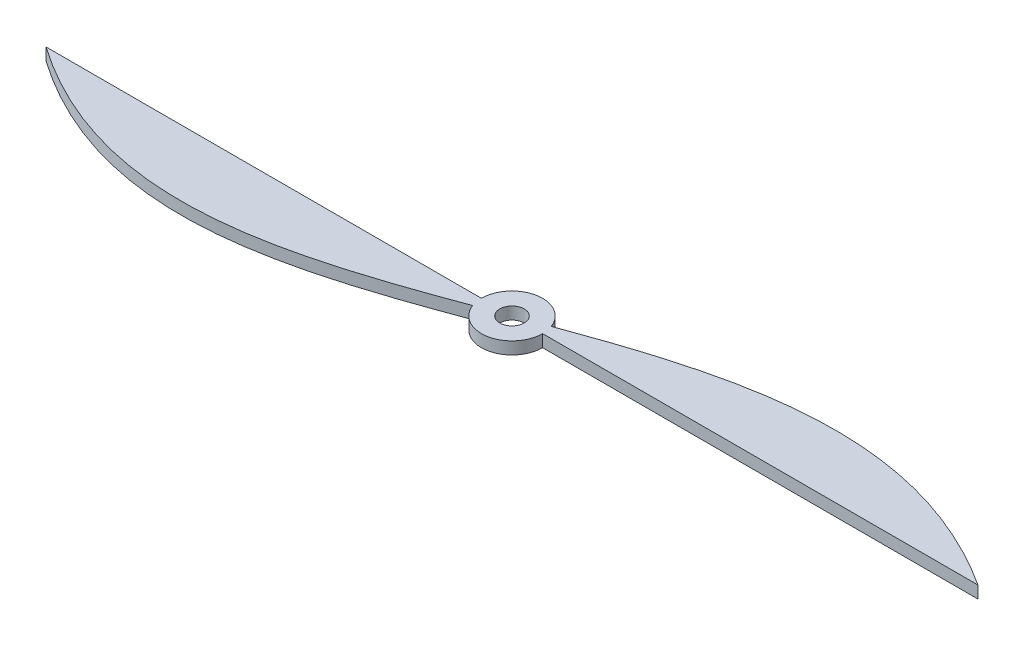
ISO-10303-21;
HEADER;
FILE_DESCRIPTION(('STEP AP214'),'2;1');
FILE_NAME('part.step','',(''),(''),'','','');
FILE_SCHEMA(('AUTOMOTIVE_DESIGN { 1 0 10303 214 1 1 1 1 }'));
ENDSEC;
DATA;
#1=APPLICATION_CONTEXT('core data for automotive mechanical design processes');
#2=APPLICATION_PROTOCOL_DEFINITION('international standard','automotive_design',2000,#1);
#3=PRODUCT_CONTEXT('',#1,'mechanical');
#4=PRODUCT('Part','Part','',(#3));
#5=PRODUCT_RELATED_PRODUCT_CATEGORY('part','',(#4));
#6=PRODUCT_DEFINITION_FORMATION('','',#4);
#7=PRODUCT_DEFINITION_CONTEXT('part definition',#1,'design');
#8=PRODUCT_DEFINITION('design','',#6,#7);
#9=PRODUCT_DEFINITION_SHAPE('','',#8);
#10=(LENGTH_UNIT() NAMED_UNIT(*) SI_UNIT(.MILLI.,.METRE.));
#11=(NAMED_UNIT(*) PLANE_ANGLE_UNIT() SI_UNIT($,.RADIAN.));
#12=(NAMED_UNIT(*) SI_UNIT($,.STERADIAN.) SOLID_ANGLE_UNIT());
#13=UNCERTAINTY_MEASURE_WITH_UNIT(LENGTH_MEASURE(1.E-05),#10,'distance_accuracy_value','');
#14=(GEOMETRIC_REPRESENTATION_CONTEXT(3) GLOBAL_UNCERTAINTY_ASSIGNED_CONTEXT((#13)) GLOBAL_UNIT_ASSIGNED_CONTEXT((#10,
#11,#12)) REPRESENTATION_CONTEXT('',''));
#15=CARTESIAN_POINT('',(0.,0.,0.));
#16=DIRECTION('',(0.,0.,1.));
#17=DIRECTION('',(1.,0.,0.));
#18=AXIS2_PLACEMENT_3D('',#15,#16,#17);
#19=CARTESIAN_POINT('',(0.,2.,0.));
#20=DIRECTION('',(0.,-1.,0.));
#21=DIRECTION('',(0.,0.,-1.));
#22=AXIS2_PLACEMENT_3D('',#19,#20,#21);
#23=CYLINDRICAL_SURFACE('',#22,5.);
#24=CARTESIAN_POINT('',(0.,0.,0.));
#25=DIRECTION('',(0.,1.,0.));
#26=DIRECTION('',(0.,0.,1.));
#27=AXIS2_PLACEMENT_3D('',#24,#25,#26);
#28=CIRCLE('',#27,5.);
#29=CARTESIAN_POINT('',(-4.68692498776939,0.,1.74147470812037));
#30=VERTEX_POINT('',#29);
#31=CARTESIAN_POINT('',(5.,0.,0.));
#32=VERTEX_POINT('',#31);
#33=EDGE_CURVE('E168',#30,#32,#28,.T.);
#34=ORIENTED_EDGE('',*,*,#33,.T.);
#35=DIRECTION('',(0.,-1.,0.));
#36=VECTOR('',#35,1.);
#37=CARTESIAN_POINT('',(5.,2.,0.));
#38=LINE('',#37,#36);
#39=CARTESIAN_POINT('',(5.,2.,0.));
#40=VERTEX_POINT('',#39);
#41=EDGE_CURVE('E11',#40,#32,#38,.T.);
#42=ORIENTED_EDGE('',*,*,#41,.F.);
#43=CARTESIAN_POINT('',(0.,2.,0.));
#44=DIRECTION('',(0.,1.,0.));
#45=DIRECTION('',(0.,0.,1.));
#46=AXIS2_PLACEMENT_3D('',#43,#44,#45);
#47=CIRCLE('',#46,5.);
#48=CARTESIAN_POINT('',(-4.68692498776939,2.,1.74147470812037));
#49=VERTEX_POINT('',#48);
#50=EDGE_CURVE('E143',#49,#40,#47,.T.);
#51=ORIENTED_EDGE('',*,*,#50,.F.);
#52=DIRECTION('',(0.,-1.,0.));
#53=VECTOR('',#52,1.);
#54=CARTESIAN_POINT('',(-4.68692498776939,2.,1.74147470812037));
#55=LINE('',#54,#53);
#56=EDGE_CURVE('E157',#49,#30,#55,.T.);
#57=ORIENTED_EDGE('',*,*,#56,.T.);
#58=EDGE_LOOP('',(#34,#42,#51,#57));
#59=FACE_BOUND('',#58,.T.);
#60=ADVANCED_FACE('F30',(#59),#23,.T.);
#61=CARTESIAN_POINT('',(0.,2.,0.));
#62=DIRECTION('',(0.,0.,-1.));
#63=DIRECTION('',(-1.,0.,0.));
#64=AXIS2_PLACEMENT_3D('',#61,#62,#63);
#65=PLANE('',#64);
#66=DIRECTION('',(1.,0.,0.));
#67=VECTOR('',#66,1.);
#68=CARTESIAN_POINT('',(0.,0.,0.));
#69=LINE('',#68,#67);
#70=CARTESIAN_POINT('',(76.2,0.,0.));
#71=VERTEX_POINT('',#70);
#72=EDGE_CURVE('E164',#32,#71,#69,.T.);
#73=ORIENTED_EDGE('',*,*,#72,.T.);
#74=DIRECTION('',(0.,-1.,0.));
#75=VECTOR('',#74,1.);
#76=CARTESIAN_POINT('',(76.2,2.,0.));
#77=LINE('',#76,#75);
#78=CARTESIAN_POINT('',(76.2,2.,0.));
#79=VERTEX_POINT('',#78);
#80=EDGE_CURVE('E38',#79,#71,#77,.T.);
#81=ORIENTED_EDGE('',*,*,#80,.F.);
#82=DIRECTION('',(1.,0.,0.));
#83=VECTOR('',#82,1.);
#84=CARTESIAN_POINT('',(0.,2.,0.));
#85=LINE('',#84,#83);
#86=EDGE_CURVE('E79',#40,#79,#85,.T.);
#87=ORIENTED_EDGE('',*,*,#86,.F.);
#88=ORIENTED_EDGE('',*,*,#41,.T.);
#89=EDGE_LOOP('',(#73,#81,#87,#88));
#90=FACE_BOUND('',#89,.T.);
#91=ADVANCED_FACE('F133',(#90),#65,.F.);
#92=CARTESIAN_POINT('',(-76.2,2.,0.));
#93=CARTESIAN_POINT('',(-23.1930493864501,2.,37.0059512644246));
#94=CARTESIAN_POINT('',(20.4320097091821,2.,-35.9781712708018));
#95=CARTESIAN_POINT('',(76.2,2.,0.));
#96=B_SPLINE_CURVE_WITH_KNOTS('',3,(#92,#93,#94,#95),.UNSPECIFIED.,.F.,.F.,(4,4),(0.,1.),.UNSPECIFIED.);
#97=DIRECTION('',(0.,-1.,0.));
#98=VECTOR('',#97,1.);
#99=SURFACE_OF_LINEAR_EXTRUSION('',#96,#98);
#100=CARTESIAN_POINT('',(-76.2,0.,0.));
#101=CARTESIAN_POINT('',(-23.1930493864501,0.,37.0059512644246));
#102=CARTESIAN_POINT('',(20.4320097091821,0.,-35.9781712708018));
#103=CARTESIAN_POINT('',(76.2,0.,0.));
#104=B_SPLINE_CURVE_WITH_KNOTS('',3,(#100,#101,#102,#103),.UNSPECIFIED.,.F.,.F.,(4,4),(0.,1.),.UNSPECIFIED.);
#105=CARTESIAN_POINT('',(4.69008689020187,0.,-1.73294113066675));
#106=VERTEX_POINT('',#105);
#107=EDGE_CURVE('E163',#106,#71,#104,.T.);
#108=ORIENTED_EDGE('',*,*,#107,.F.);
#109=DIRECTION('',(0.,-1.,0.));
#110=VECTOR('',#109,1.);
#111=CARTESIAN_POINT('',(4.69008689020187,2.,-1.73294113066675));
#112=LINE('',#111,#110);
#113=CARTESIAN_POINT('',(4.69008689020187,2.,-1.73294113066675));
#114=VERTEX_POINT('',#113);
#115=EDGE_CURVE('E105',#114,#106,#112,.T.);
#116=ORIENTED_EDGE('',*,*,#115,.F.);
#117=EDGE_CURVE('E94',#114,#79,#96,.T.);
#118=ORIENTED_EDGE('',*,*,#117,.T.);
#119=ORIENTED_EDGE('',*,*,#80,.T.);
#120=EDGE_LOOP('',(#108,#116,#118,#119));
#121=FACE_BOUND('',#120,.T.);
#122=ADVANCED_FACE('F131',(#121),#99,.T.);
#123=CARTESIAN_POINT('',(0.,2.,0.));
#124=DIRECTION('',(0.,-1.,0.));
#125=DIRECTION('',(0.,0.,-1.));
#126=AXIS2_PLACEMENT_3D('',#123,#124,#125);
#127=CYLINDRICAL_SURFACE('',#126,5.);
#128=CARTESIAN_POINT('',(0.,0.,0.));
#129=DIRECTION('',(0.,1.,0.));
#130=DIRECTION('',(0.,0.,1.));
#131=AXIS2_PLACEMENT_3D('',#128,#129,#130);
#132=CIRCLE('',#131,5.);
#133=CARTESIAN_POINT('',(-5.,0.,0.));
#134=VERTEX_POINT('',#133);
#135=EDGE_CURVE('E101',#106,#134,#132,.T.);
#136=ORIENTED_EDGE('',*,*,#135,.T.);
#137=DIRECTION('',(0.,-1.,0.));
#138=VECTOR('',#137,1.);
#139=CARTESIAN_POINT('',(-5.,2.,0.));
#140=LINE('',#139,#138);
#141=CARTESIAN_POINT('',(-5.,2.,0.));
#142=VERTEX_POINT('',#141);
#143=EDGE_CURVE('E98',#142,#134,#140,.T.);
#144=ORIENTED_EDGE('',*,*,#143,.F.);
#145=CARTESIAN_POINT('',(0.,2.,0.));
#146=DIRECTION('',(0.,1.,0.));
#147=DIRECTION('',(0.,0.,1.));
#148=AXIS2_PLACEMENT_3D('',#145,#146,#147);
#149=CIRCLE('',#148,5.);
#150=EDGE_CURVE('E87',#114,#142,#149,.T.);
#151=ORIENTED_EDGE('',*,*,#150,.F.);
#152=ORIENTED_EDGE('',*,*,#115,.T.);
#153=EDGE_LOOP('',(#136,#144,#151,#152));
#154=FACE_BOUND('',#153,.T.);
#155=ADVANCED_FACE('F99',(#154),#127,.T.);
#156=CARTESIAN_POINT('',(0.,2.,0.));
#157=DIRECTION('',(0.,0.,-1.));
#158=DIRECTION('',(-1.,0.,0.));
#159=AXIS2_PLACEMENT_3D('',#156,#157,#158);
#160=PLANE('',#159);
#161=DIRECTION('',(1.,0.,0.));
#162=VECTOR('',#161,1.);
#163=CARTESIAN_POINT('',(0.,0.,0.));
#164=LINE('',#163,#162);
#165=CARTESIAN_POINT('',(-76.2,0.,0.));
#166=VERTEX_POINT('',#165);
#167=EDGE_CURVE('E151',#166,#134,#164,.T.);
#168=ORIENTED_EDGE('',*,*,#167,.F.);
#169=DIRECTION('',(0.,-1.,0.));
#170=VECTOR('',#169,1.);
#171=CARTESIAN_POINT('',(-76.2,2.,0.));
#172=LINE('',#171,#170);
#173=CARTESIAN_POINT('',(-76.2,2.,0.));
#174=VERTEX_POINT('',#173);
#175=EDGE_CURVE('E68',#174,#166,#172,.T.);
#176=ORIENTED_EDGE('',*,*,#175,.F.);
#177=DIRECTION('',(1.,0.,0.));
#178=VECTOR('',#177,1.);
#179=CARTESIAN_POINT('',(0.,2.,0.));
#180=LINE('',#179,#178);
#181=EDGE_CURVE('E92',#174,#142,#180,.T.);
#182=ORIENTED_EDGE('',*,*,#181,.T.);
#183=ORIENTED_EDGE('',*,*,#143,.T.);
#184=EDGE_LOOP('',(#168,#176,#182,#183));
#185=FACE_BOUND('',#184,.T.);
#186=ADVANCED_FACE('F107',(#185),#160,.T.);
#187=CARTESIAN_POINT('',(-76.2,2.,0.));
#188=CARTESIAN_POINT('',(-23.1930493864501,2.,37.0059512644246));
#189=CARTESIAN_POINT('',(20.4320097091821,2.,-35.9781712708018));
#190=CARTESIAN_POINT('',(76.2,2.,0.));
#191=B_SPLINE_CURVE_WITH_KNOTS('',3,(#187,#188,#189,#190),.UNSPECIFIED.,.F.,.F.,(4,4),(0.,1.),.UNSPECIFIED.);
#192=DIRECTION('',(0.,-1.,0.));
#193=VECTOR('',#192,1.);
#194=SURFACE_OF_LINEAR_EXTRUSION('',#191,#193);
#195=CARTESIAN_POINT('',(-76.2,0.,0.));
#196=CARTESIAN_POINT('',(-23.1930493864501,0.,37.0059512644246));
#197=CARTESIAN_POINT('',(20.4320097091821,0.,-35.9781712708018));
#198=CARTESIAN_POINT('',(76.2,0.,0.));
#199=B_SPLINE_CURVE_WITH_KNOTS('',3,(#195,#196,#197,#198),.UNSPECIFIED.,.F.,.F.,(4,4),(0.,1.),.UNSPECIFIED.);
#200=EDGE_CURVE('E71',#166,#30,#199,.T.);
#201=ORIENTED_EDGE('',*,*,#200,.T.);
#202=ORIENTED_EDGE('',*,*,#56,.F.);
#203=EDGE_CURVE('E46',#174,#49,#191,.T.);
#204=ORIENTED_EDGE('',*,*,#203,.F.);
#205=ORIENTED_EDGE('',*,*,#175,.T.);
#206=EDGE_LOOP('',(#201,#202,#204,#205));
#207=FACE_BOUND('',#206,.T.);
#208=ADVANCED_FACE('F121',(#207),#194,.F.);
#209=CARTESIAN_POINT('',(0.,2.,0.));
#210=DIRECTION('',(0.,-1.,0.));
#211=DIRECTION('',(0.,0.,-1.));
#212=AXIS2_PLACEMENT_3D('',#209,#210,#211);
#213=CYLINDRICAL_SURFACE('',#212,2.);
#214=CARTESIAN_POINT('',(0.,2.,0.));
#215=DIRECTION('',(0.,1.,0.));
#216=DIRECTION('',(0.,0.,1.));
#217=AXIS2_PLACEMENT_3D('',#214,#215,#216);
#218=CIRCLE('',#217,2.);
#219=CARTESIAN_POINT('',(0.,2.,2.));
#220=VERTEX_POINT('',#219);
#221=EDGE_CURVE('E109',#220,#220,#218,.T.);
#222=ORIENTED_EDGE('',*,*,#221,.T.);
#223=EDGE_LOOP('',(#222));
#224=FACE_BOUND('',#223,.T.);
#225=CARTESIAN_POINT('',(0.,0.,0.));
#226=DIRECTION('',(0.,1.,0.));
#227=DIRECTION('',(0.,0.,1.));
#228=AXIS2_PLACEMENT_3D('',#225,#226,#227);
#229=CIRCLE('',#228,2.);
#230=CARTESIAN_POINT('',(0.,0.,2.));
#231=VERTEX_POINT('',#230);
#232=EDGE_CURVE('E144',#231,#231,#229,.T.);
#233=ORIENTED_EDGE('',*,*,#232,.F.);
#234=EDGE_LOOP('',(#233));
#235=FACE_BOUND('',#234,.T.);
#236=ADVANCED_FACE('F125',(#224,#235),#213,.F.);
#237=CARTESIAN_POINT('',(0.,2.,0.));
#238=DIRECTION('',(0.,1.,0.));
#239=DIRECTION('',(0.,0.,1.));
#240=AXIS2_PLACEMENT_3D('',#237,#238,#239);
#241=PLANE('',#240);
#242=ORIENTED_EDGE('',*,*,#50,.T.);
#243=ORIENTED_EDGE('',*,*,#86,.T.);
#244=ORIENTED_EDGE('',*,*,#117,.F.);
#245=ORIENTED_EDGE('',*,*,#150,.T.);
#246=ORIENTED_EDGE('',*,*,#181,.F.);
#247=ORIENTED_EDGE('',*,*,#203,.T.);
#248=EDGE_LOOP('',(#242,#243,#244,#245,#246,#247));
#249=FACE_BOUND('',#248,.T.);
#250=ORIENTED_EDGE('',*,*,#221,.F.);
#251=EDGE_LOOP('',(#250));
#252=FACE_BOUND('',#251,.T.);
#253=ADVANCED_FACE('F89',(#249,#252),#241,.T.);
#254=CARTESIAN_POINT('',(0.,0.,0.));
#255=DIRECTION('',(0.,1.,0.));
#256=DIRECTION('',(0.,0.,1.));
#257=AXIS2_PLACEMENT_3D('',#254,#255,#256);
#258=PLANE('',#257);
#259=ORIENTED_EDGE('',*,*,#33,.F.);
#260=ORIENTED_EDGE('',*,*,#200,.F.);
#261=ORIENTED_EDGE('',*,*,#167,.T.);
#262=ORIENTED_EDGE('',*,*,#135,.F.);
#263=ORIENTED_EDGE('',*,*,#107,.T.);
#264=ORIENTED_EDGE('',*,*,#72,.F.);
#265=EDGE_LOOP('',(#259,#260,#261,#262,#263,#264));
#266=FACE_BOUND('',#265,.T.);
#267=ORIENTED_EDGE('',*,*,#232,.T.);
#268=EDGE_LOOP('',(#267));
#269=FACE_BOUND('',#268,.T.);
#270=ADVANCED_FACE('F170',(#266,#269),#258,.F.);
#271=CLOSED_SHELL('',(#60,#91,#122,#155,#186,#208,#236,#253,#270));
#272=MANIFOLD_SOLID_BREP('B2',#271);
#273=ADVANCED_BREP_SHAPE_REPRESENTATION('',(#18,#272),#14);
#274=SHAPE_DEFINITION_REPRESENTATION(#9,#273);
ENDSEC;
END-ISO-10303-21;
